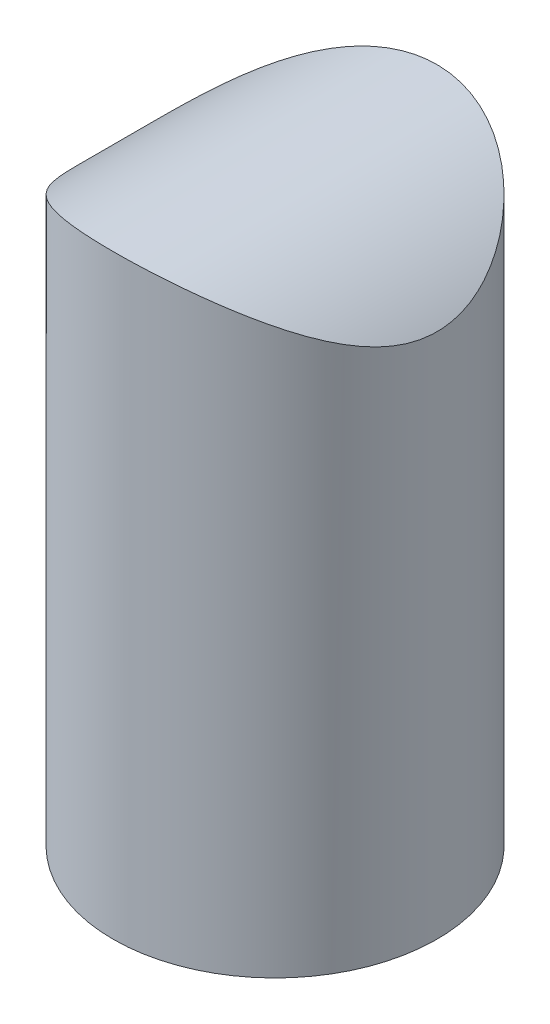
ISO-10303-21;
HEADER;
FILE_DESCRIPTION(('STEP AP214'),'2;1');
FILE_NAME('part.step','',(''),(''),'','','');
FILE_SCHEMA(('AUTOMOTIVE_DESIGN { 1 0 10303 214 1 1 1 1 }'));
ENDSEC;
DATA;
#1=APPLICATION_CONTEXT('core data for automotive mechanical design processes');
#2=APPLICATION_PROTOCOL_DEFINITION('international standard','automotive_design',2000,#1);
#3=PRODUCT_CONTEXT('',#1,'mechanical');
#4=PRODUCT('Part','Part','',(#3));
#5=PRODUCT_RELATED_PRODUCT_CATEGORY('part','',(#4));
#6=PRODUCT_DEFINITION_FORMATION('','',#4);
#7=PRODUCT_DEFINITION_CONTEXT('part definition',#1,'design');
#8=PRODUCT_DEFINITION('design','',#6,#7);
#9=PRODUCT_DEFINITION_SHAPE('','',#8);
#10=(LENGTH_UNIT() NAMED_UNIT(*) SI_UNIT(.MILLI.,.METRE.));
#11=(NAMED_UNIT(*) PLANE_ANGLE_UNIT() SI_UNIT($,.RADIAN.));
#12=(NAMED_UNIT(*) SI_UNIT($,.STERADIAN.) SOLID_ANGLE_UNIT());
#13=UNCERTAINTY_MEASURE_WITH_UNIT(LENGTH_MEASURE(1.E-05),#10,'distance_accuracy_value','');
#14=(GEOMETRIC_REPRESENTATION_CONTEXT(3) GLOBAL_UNCERTAINTY_ASSIGNED_CONTEXT((#13)) GLOBAL_UNIT_ASSIGNED_CONTEXT((#10,
#11,#12)) REPRESENTATION_CONTEXT('',''));
#15=CARTESIAN_POINT('',(0.,0.,0.));
#16=DIRECTION('',(0.,0.,1.));
#17=DIRECTION('',(1.,0.,0.));
#18=AXIS2_PLACEMENT_3D('',#15,#16,#17);
#19=CARTESIAN_POINT('',(7.5,7.56,0.));
#20=DIRECTION('',(0.,0.,-1.));
#21=DIRECTION('',(-1.,0.,0.));
#22=AXIS2_PLACEMENT_3D('',#19,#20,#21);
#23=CYLINDRICAL_SURFACE('',#22,1.5);
#24=CARTESIAN_POINT('',(7.50000000000001,9.06,1.0875));
#25=CARTESIAN_POINT('',(7.44645318983787,9.05999606330348,1.08749587762653));
#26=CARTESIAN_POINT('',(7.39283470574898,9.05710298009112,1.08351477089866));
#27=CARTESIAN_POINT('',(7.28728519841196,9.04579439976247,1.06783405542802));
#28=CARTESIAN_POINT('',(7.23535796360719,9.03736729437451,1.05611822189706));
#29=CARTESIAN_POINT('',(7.13497463701635,9.01580829555622,1.0257424956715));
#30=CARTESIAN_POINT('',(7.08650044466455,9.00270349682675,1.00712257008705));
#31=CARTESIAN_POINT('',(6.99364922074938,8.97279564706435,0.963791015189185));
#32=CARTESIAN_POINT('',(6.94927140591245,8.95599330513128,0.939080553785161));
#33=CARTESIAN_POINT('',(6.86129094912606,8.91814090393425,0.881876361447315));
#34=CARTESIAN_POINT('',(6.81812365934626,8.89684380503885,0.848879979424961));
#35=CARTESIAN_POINT('',(6.73755514958574,8.85259269541275,0.777330741794158));
#36=CARTESIAN_POINT('',(6.70016303991649,8.82963614898154,0.738769288968826));
#37=CARTESIAN_POINT('',(6.6249128229369,8.7792770057588,0.648804015173829));
#38=CARTESIAN_POINT('',(6.58831255707057,8.75185731013435,0.596351757048343));
#39=CARTESIAN_POINT('',(6.52436886794089,8.70010079645261,0.484691086546724));
#40=CARTESIAN_POINT('',(6.49701122473895,8.67575927900331,0.425493241781905));
#41=CARTESIAN_POINT('',(6.46010561511065,8.64122070054972,0.321318028234869));
#42=CARTESIAN_POINT('',(6.44765932652514,8.62900310978267,0.278046354148421));
#43=CARTESIAN_POINT('',(6.42814005546762,8.60943304226713,0.189283044014699));
#44=CARTESIAN_POINT('',(6.42105526892179,8.602069882465,0.143796520827709));
#45=CARTESIAN_POINT('',(6.4127174594264,8.59337211283035,0.0513558610726995));
#46=CARTESIAN_POINT('',(6.41150635435831,8.59208083734755,0.00439357595784104));
#47=CARTESIAN_POINT('',(6.41514164135491,8.59589910983395,-0.0890462259179675));
#48=CARTESIAN_POINT('',(6.41999261593768,8.60101350005539,-0.135523349137112));
#49=CARTESIAN_POINT('',(6.43625739539225,8.61763764076708,-0.231888248622057));
#50=CARTESIAN_POINT('',(6.44837635559378,8.62982918991069,-0.281533719684335));
#51=CARTESIAN_POINT('',(6.47884776638971,8.65894930335497,-0.37742394932658));
#52=CARTESIAN_POINT('',(6.49721451241396,8.67588871535417,-0.423660610418429));
#53=CARTESIAN_POINT('',(6.54651608707371,8.71855475460472,-0.527077487075883));
#54=CARTESIAN_POINT('',(6.57959904862357,8.74533170180359,-0.582795329784135));
#55=CARTESIAN_POINT('',(6.65470596646912,8.80001801238154,-0.687222868952797));
#56=CARTESIAN_POINT('',(6.69673914845887,8.82792852000165,-0.735925246511732));
#57=CARTESIAN_POINT('',(6.7898535276485,8.88236079904336,-0.826196323855526));
#58=CARTESIAN_POINT('',(6.84103618244584,8.90886215875795,-0.867673505464197));
#59=CARTESIAN_POINT('',(6.95151227438883,8.95741911647548,-0.941383113767995));
#60=CARTESIAN_POINT('',(7.01078956687297,8.97948335295439,-0.973633556465765));
#61=CARTESIAN_POINT('',(7.12007608048811,9.01190638515636,-1.02023968448157));
#62=CARTESIAN_POINT('',(7.16857959455386,9.02381564447129,-1.03706243541614));
#63=CARTESIAN_POINT('',(7.26829919137198,9.04285952976451,-1.06377539054145));
#64=CARTESIAN_POINT('',(7.31950802717833,9.05000627671074,-1.073683196878));
#65=CARTESIAN_POINT('',(7.39262929619465,9.0563062588704,-1.08240046013438));
#66=CARTESIAN_POINT('',(7.41402979216679,9.05768828710845,-1.08430957999276));
#67=CARTESIAN_POINT('',(7.45694964674994,9.05953604465824,-1.08686031085237));
#68=CARTESIAN_POINT('',(7.47846902920517,9.06000158293086,-1.08750165759086));
#69=CARTESIAN_POINT('',(7.55354681016213,9.05999606330349,-1.08749587762654));
#70=CARTESIAN_POINT('',(7.60716529425101,9.05710298009112,-1.08351477089867));
#71=CARTESIAN_POINT('',(7.71271480158804,9.04579439976247,-1.06783405542801));
#72=CARTESIAN_POINT('',(7.76464203639281,9.03736729437451,-1.05611822189706));
#73=CARTESIAN_POINT('',(7.86502536298364,9.01580829555622,-1.0257424956715));
#74=CARTESIAN_POINT('',(7.91349955533544,9.00270349682675,-1.00712257008705));
#75=CARTESIAN_POINT('',(8.00635077925062,8.97279564706435,-0.963791015189187));
#76=CARTESIAN_POINT('',(8.05072859408755,8.95599330513129,-0.939080553785163));
#77=CARTESIAN_POINT('',(8.13870905087393,8.91814090393425,-0.881876361447318));
#78=CARTESIAN_POINT('',(8.18187634065373,8.89684380503885,-0.848879979424964));
#79=CARTESIAN_POINT('',(8.26244485041425,8.85259269541275,-0.777330741794162));
#80=CARTESIAN_POINT('',(8.2998369600835,8.82963614898154,-0.738769288968829));
#81=CARTESIAN_POINT('',(8.3750871770631,8.7792770057588,-0.648804015173832));
#82=CARTESIAN_POINT('',(8.41168744292943,8.75185731013435,-0.596351757048345));
#83=CARTESIAN_POINT('',(8.47563113205911,8.70010079645261,-0.484691086546728));
#84=CARTESIAN_POINT('',(8.50298877526105,8.67575927900331,-0.425493241781909));
#85=CARTESIAN_POINT('',(8.53989438488935,8.64122070054972,-0.321318028234873));
#86=CARTESIAN_POINT('',(8.55234067347486,8.62900310978267,-0.278046354148426));
#87=CARTESIAN_POINT('',(8.57185994453238,8.60943304226713,-0.189283044014703));
#88=CARTESIAN_POINT('',(8.57894473107821,8.602069882465,-0.143796520827713));
#89=CARTESIAN_POINT('',(8.5872825405736,8.59337211283035,-0.0513558610727028));
#90=CARTESIAN_POINT('',(8.58849364564169,8.59208083734755,-0.0043935759578442));
#91=CARTESIAN_POINT('',(8.58485835864509,8.59589910983395,0.0890462259179647));
#92=CARTESIAN_POINT('',(8.58000738406232,8.60101350005539,0.135523349137109));
#93=CARTESIAN_POINT('',(8.56374260460775,8.61763764076708,0.231888248622055));
#94=CARTESIAN_POINT('',(8.55162364440622,8.62982918991069,0.281533719684332));
#95=CARTESIAN_POINT('',(8.52115223361029,8.65894930335497,0.377423949326577));
#96=CARTESIAN_POINT('',(8.50278548758604,8.67588871535417,0.423660610418425));
#97=CARTESIAN_POINT('',(8.45348391292629,8.71855475460471,0.527077487075879));
#98=CARTESIAN_POINT('',(8.42040095137643,8.74533170180359,0.582795329784132));
#99=CARTESIAN_POINT('',(8.34529403353088,8.80001801238154,0.687222868952794));
#100=CARTESIAN_POINT('',(8.30326085154114,8.82792852000164,0.735925246511729));
#101=CARTESIAN_POINT('',(8.21014647235151,8.88236079904336,0.826196323855523));
#102=CARTESIAN_POINT('',(8.15896381755417,8.90886215875794,0.867673505464193));
#103=CARTESIAN_POINT('',(8.04848772561117,8.95741911647548,0.941383113767991));
#104=CARTESIAN_POINT('',(7.98921043312703,8.97948335295439,0.973633556465762));
#105=CARTESIAN_POINT('',(7.87992391951189,9.01190638515636,1.02023968448157));
#106=CARTESIAN_POINT('',(7.83142040544615,9.02381564447129,1.03706243541614));
#107=CARTESIAN_POINT('',(7.73170080862802,9.04285952976451,1.06377539054145));
#108=CARTESIAN_POINT('',(7.68049197282167,9.05000627671074,1.073683196878));
#109=CARTESIAN_POINT('',(7.60737070380535,9.0563062588704,1.08240046013438));
#110=CARTESIAN_POINT('',(7.58597020783321,9.05768828710846,1.08430957999276));
#111=CARTESIAN_POINT('',(7.54305035325006,9.05953604465824,1.08686031085237));
#112=CARTESIAN_POINT('',(7.52153097079482,9.06000158293085,1.08750165759086));
#113=CARTESIAN_POINT('',(7.50000000000001,9.06,1.0875));
#114=B_SPLINE_CURVE_WITH_KNOTS('',3,(#24,#25,#26,#27,#28,#29,#30,#31,#32,#33,#34,#35,#36,#37,
#38,#39,#40,#41,#42,#43,#44,#45,#46,#47,#48,#49,#50,#51,#52,#53,#54,#55,#56,#57,#58,#59,#60,#61,
#62,#63,#64,#65,#66,#67,#68,#69,#70,#71,#72,#73,#74,#75,#76,#77,#78,#79,#80,#81,#82,#83,#84,#85,
#86,#87,#88,#89,#90,#91,#92,#93,#94,#95,#96,#97,#98,#99,#100,#101,#102,#103,#104,#105,#106,#107,
#108,#109,#110,#111,#112,#113),.UNSPECIFIED.,.T.,.F.,(4,2,2,2,2,2,2,2,2,2,2,2,2,2,2,2,2,2,2,2,2,
2,2,2,2,2,2,2,2,2,2,2,2,2,2,2,2,2,2,2,2,2,2,2,4),(0.,0.160548283279003,0.321434416086763,
0.481403376879996,0.64134168616689,0.815785862556172,0.990502473123994,1.19837104178674,
1.40591832887432,1.54537939903408,1.68453252622657,1.8246772813433,1.96492804043387,
2.1216840413525,2.27880115228494,2.48807512533432,2.69756586686036,2.90954274308126,
3.12110284638193,3.27856847953248,3.43563180390063,3.50017421202593,3.56473007236515,
3.72527835564415,3.88616448845191,4.04613344924515,4.20607175853204,4.38051593492132,
4.55523254548915,4.76310111415189,4.97064840123947,5.11010947139923,5.24926259859172,
5.38940735370845,5.52965811279902,5.68641411371765,5.84353122465009,6.05280519769947,
6.2622959392255,6.47427281544641,6.68583291874707,6.84329855189763,7.00036187626577,
7.06490428439109,7.12946014473031),.UNSPECIFIED.);
#115=CARTESIAN_POINT('',(7.50000000000001,9.06,1.0875));
#116=VERTEX_POINT('',#115);
#117=EDGE_CURVE('E18',#116,#116,#114,.T.);
#118=ORIENTED_EDGE('',*,*,#117,.F.);
#119=EDGE_LOOP('',(#118));
#120=FACE_BOUND('',#119,.T.);
#121=ADVANCED_FACE('F14',(#120),#23,.T.);
#122=CARTESIAN_POINT('',(9.,5.06,0.));
#123=DIRECTION('',(0.,1.,0.));
#124=DIRECTION('',(0.,0.,1.));
#125=AXIS2_PLACEMENT_3D('',#122,#123,#124);
#126=PLANE('',#125);
#127=CARTESIAN_POINT('',(7.5,5.06,0.));
#128=DIRECTION('',(0.,1.,0.));
#129=DIRECTION('',(0.,0.,1.));
#130=AXIS2_PLACEMENT_3D('',#127,#128,#129);
#131=CIRCLE('',#130,1.0875);
#132=CARTESIAN_POINT('',(7.5,5.06,1.0875));
#133=VERTEX_POINT('',#132);
#134=EDGE_CURVE('E10',#133,#133,#131,.T.);
#135=ORIENTED_EDGE('',*,*,#134,.F.);
#136=EDGE_LOOP('',(#135));
#137=FACE_BOUND('',#136,.T.);
#138=ADVANCED_FACE('F34',(#137),#126,.F.);
#139=CARTESIAN_POINT('',(7.5,7.56,0.));
#140=DIRECTION('',(0.,1.,0.));
#141=DIRECTION('',(0.,0.,1.));
#142=AXIS2_PLACEMENT_3D('',#139,#140,#141);
#143=CYLINDRICAL_SURFACE('',#142,1.0875);
#144=ORIENTED_EDGE('',*,*,#117,.T.);
#145=EDGE_LOOP('',(#144));
#146=FACE_BOUND('',#145,.T.);
#147=ORIENTED_EDGE('',*,*,#134,.T.);
#148=EDGE_LOOP('',(#147));
#149=FACE_BOUND('',#148,.T.);
#150=ADVANCED_FACE('F31',(#146,#149),#143,.T.);
#151=CLOSED_SHELL('',(#121,#138,#150));
#152=MANIFOLD_SOLID_BREP('B1',#151);
#153=ADVANCED_BREP_SHAPE_REPRESENTATION('',(#18,#152),#14);
#154=SHAPE_DEFINITION_REPRESENTATION(#9,#153);
ENDSEC;
END-ISO-10303-21;
